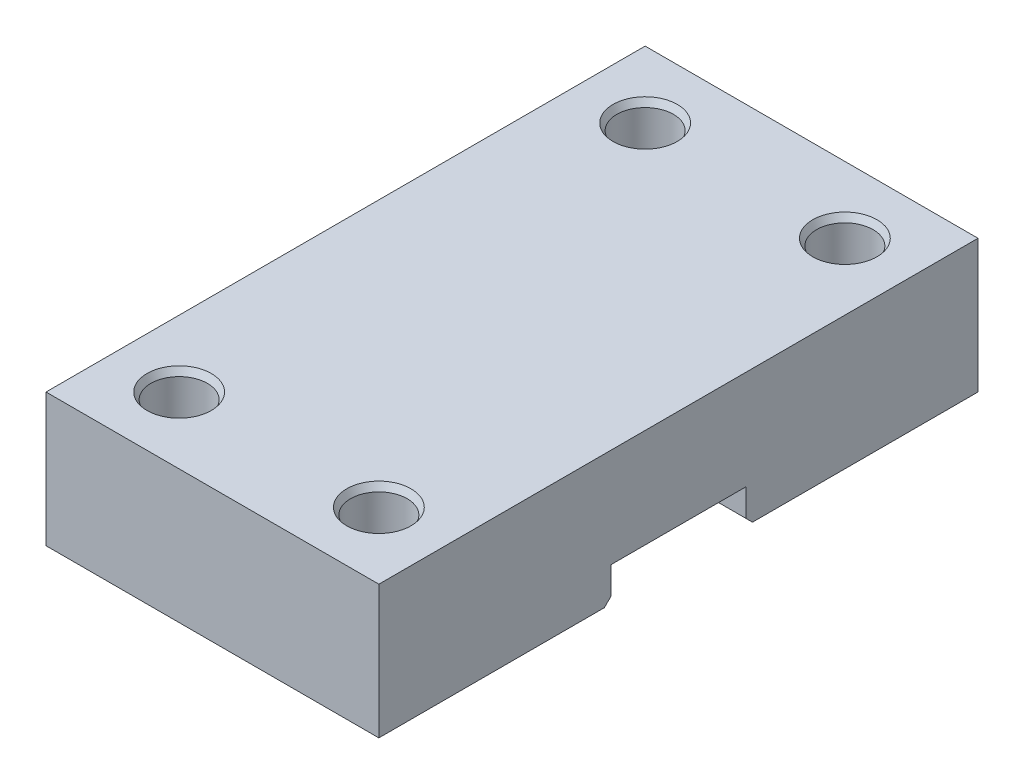
ISO-10303-21;
HEADER;
FILE_DESCRIPTION(('STEP AP214'),'2;1');
FILE_NAME('part.step','',(''),(''),'','','');
FILE_SCHEMA(('AUTOMOTIVE_DESIGN { 1 0 10303 214 1 1 1 1 }'));
ENDSEC;
DATA;
#1=APPLICATION_CONTEXT('core data for automotive mechanical design processes');
#2=APPLICATION_PROTOCOL_DEFINITION('international standard','automotive_design',2000,#1);
#3=PRODUCT_CONTEXT('',#1,'mechanical');
#4=PRODUCT('Part','Part','',(#3));
#5=PRODUCT_RELATED_PRODUCT_CATEGORY('part','',(#4));
#6=PRODUCT_DEFINITION_FORMATION('','',#4);
#7=PRODUCT_DEFINITION_CONTEXT('part definition',#1,'design');
#8=PRODUCT_DEFINITION('design','',#6,#7);
#9=PRODUCT_DEFINITION_SHAPE('','',#8);
#10=(LENGTH_UNIT() NAMED_UNIT(*) SI_UNIT(.MILLI.,.METRE.));
#11=(NAMED_UNIT(*) PLANE_ANGLE_UNIT() SI_UNIT($,.RADIAN.));
#12=(NAMED_UNIT(*) SI_UNIT($,.STERADIAN.) SOLID_ANGLE_UNIT());
#13=UNCERTAINTY_MEASURE_WITH_UNIT(LENGTH_MEASURE(1.E-05),#10,'distance_accuracy_value','');
#14=(GEOMETRIC_REPRESENTATION_CONTEXT(3) GLOBAL_UNCERTAINTY_ASSIGNED_CONTEXT((#13)) GLOBAL_UNIT_ASSIGNED_CONTEXT((#10,
#11,#12)) REPRESENTATION_CONTEXT('',''));
#15=CARTESIAN_POINT('',(0.,0.,0.));
#16=DIRECTION('',(0.,0.,1.));
#17=DIRECTION('',(1.,0.,0.));
#18=AXIS2_PLACEMENT_3D('',#15,#16,#17);
#19=CARTESIAN_POINT('',(0.,0.,0.));
#20=DIRECTION('',(0.,1.,0.));
#21=DIRECTION('',(0.,0.,1.));
#22=AXIS2_PLACEMENT_3D('',#19,#20,#21);
#23=PLANE('',#22);
#24=CARTESIAN_POINT('',(15.,0.,35.));
#25=DIRECTION('',(0.,-1.,0.));
#26=DIRECTION('',(0.,0.,-1.));
#27=AXIS2_PLACEMENT_3D('',#24,#25,#26);
#28=CIRCLE('',#27,4.25);
#29=CARTESIAN_POINT('',(15.,0.,30.75));
#30=VERTEX_POINT('',#29);
#31=EDGE_CURVE('E244',#30,#30,#28,.T.);
#32=ORIENTED_EDGE('',*,*,#31,.F.);
#33=EDGE_LOOP('',(#32));
#34=FACE_BOUND('',#33,.T.);
#35=CARTESIAN_POINT('',(-15.,0.,35.));
#36=DIRECTION('',(0.,-1.,0.));
#37=DIRECTION('',(0.,0.,-1.));
#38=AXIS2_PLACEMENT_3D('',#35,#36,#37);
#39=CIRCLE('',#38,4.25);
#40=CARTESIAN_POINT('',(-15.,0.,30.75));
#41=VERTEX_POINT('',#40);
#42=EDGE_CURVE('E242',#41,#41,#39,.T.);
#43=ORIENTED_EDGE('',*,*,#42,.F.);
#44=EDGE_LOOP('',(#43));
#45=FACE_BOUND('',#44,.T.);
#46=DIRECTION('',(0.,0.,1.));
#47=VECTOR('',#46,1.);
#48=CARTESIAN_POINT('',(-25.,0.,45.));
#49=LINE('',#48,#47);
#50=CARTESIAN_POINT('',(-25.,0.,11.125));
#51=VERTEX_POINT('',#50);
#52=CARTESIAN_POINT('',(-25.,0.,45.));
#53=VERTEX_POINT('',#52);
#54=EDGE_CURVE('E145',#51,#53,#49,.T.);
#55=ORIENTED_EDGE('',*,*,#54,.F.);
#56=DIRECTION('',(1.,0.,0.));
#57=VECTOR('',#56,1.);
#58=CARTESIAN_POINT('',(0.,0.,11.125));
#59=LINE('',#58,#57);
#60=CARTESIAN_POINT('',(25.,0.,11.125));
#61=VERTEX_POINT('',#60);
#62=EDGE_CURVE('E45',#51,#61,#59,.T.);
#63=ORIENTED_EDGE('',*,*,#62,.T.);
#64=DIRECTION('',(0.,0.,-1.));
#65=VECTOR('',#64,1.);
#66=CARTESIAN_POINT('',(25.,0.,45.));
#67=LINE('',#66,#65);
#68=CARTESIAN_POINT('',(25.,0.,45.));
#69=VERTEX_POINT('',#68);
#70=EDGE_CURVE('E162',#69,#61,#67,.T.);
#71=ORIENTED_EDGE('',*,*,#70,.F.);
#72=DIRECTION('',(1.,0.,0.));
#73=VECTOR('',#72,1.);
#74=CARTESIAN_POINT('',(25.,0.,45.));
#75=LINE('',#74,#73);
#76=EDGE_CURVE('E159',#53,#69,#75,.T.);
#77=ORIENTED_EDGE('',*,*,#76,.F.);
#78=EDGE_LOOP('',(#55,#63,#71,#77));
#79=FACE_BOUND('',#78,.T.);
#80=ADVANCED_FACE('F37',(#34,#45,#79),#23,.F.);
#81=CARTESIAN_POINT('',(-25.,20.,45.));
#82=DIRECTION('',(1.,0.,0.));
#83=DIRECTION('',(0.,0.,-1.));
#84=AXIS2_PLACEMENT_3D('',#81,#82,#83);
#85=PLANE('',#84);
#86=CARTESIAN_POINT('',(-25.,0.,-45.));
#87=VERTEX_POINT('',#86);
#88=CARTESIAN_POINT('',(-25.,0.,-11.125));
#89=VERTEX_POINT('',#88);
#90=EDGE_CURVE('E157',#87,#89,#49,.T.);
#91=ORIENTED_EDGE('',*,*,#90,.T.);
#92=DIRECTION('',(0.,-0.707106781186552,-0.707106781186543));
#93=VECTOR('',#92,1.);
#94=CARTESIAN_POINT('',(-25.,1.00000000000003,-10.125));
#95=LINE('',#94,#93);
#96=CARTESIAN_POINT('',(-25.,1.00000000000003,-10.125));
#97=VERTEX_POINT('',#96);
#98=EDGE_CURVE('E120',#89,#97,#95,.F.);
#99=ORIENTED_EDGE('',*,*,#98,.T.);
#100=DIRECTION('',(0.,1.,0.));
#101=VECTOR('',#100,1.);
#102=CARTESIAN_POINT('',(-25.,5.10000000000001,-10.125));
#103=LINE('',#102,#101);
#104=CARTESIAN_POINT('',(-25.,5.10000000000001,-10.125));
#105=VERTEX_POINT('',#104);
#106=EDGE_CURVE('E113',#97,#105,#103,.T.);
#107=ORIENTED_EDGE('',*,*,#106,.T.);
#108=DIRECTION('',(0.,0.,1.));
#109=VECTOR('',#108,1.);
#110=CARTESIAN_POINT('',(-25.,5.10000000000001,-10.125));
#111=LINE('',#110,#109);
#112=CARTESIAN_POINT('',(-25.,5.1,10.125));
#113=VERTEX_POINT('',#112);
#114=EDGE_CURVE('E118',#105,#113,#111,.T.);
#115=ORIENTED_EDGE('',*,*,#114,.T.);
#116=DIRECTION('',(0.,-1.,0.));
#117=VECTOR('',#116,1.);
#118=CARTESIAN_POINT('',(-25.,5.1,10.125));
#119=LINE('',#118,#117);
#120=CARTESIAN_POINT('',(-25.,1.00000000000001,10.125));
#121=VERTEX_POINT('',#120);
#122=EDGE_CURVE('E124',#113,#121,#119,.T.);
#123=ORIENTED_EDGE('',*,*,#122,.T.);
#124=DIRECTION('',(0.,0.707106781186548,-0.707106781186548));
#125=VECTOR('',#124,1.);
#126=CARTESIAN_POINT('',(-25.,0.,11.125));
#127=LINE('',#126,#125);
#128=EDGE_CURVE('E52',#121,#51,#127,.F.);
#129=ORIENTED_EDGE('',*,*,#128,.T.);
#130=ORIENTED_EDGE('',*,*,#54,.T.);
#131=DIRECTION('',(0.,-1.,0.));
#132=VECTOR('',#131,1.);
#133=CARTESIAN_POINT('',(-25.,20.,45.));
#134=LINE('',#133,#132);
#135=CARTESIAN_POINT('',(-25.,20.,45.));
#136=VERTEX_POINT('',#135);
#137=EDGE_CURVE('E174',#136,#53,#134,.T.);
#138=ORIENTED_EDGE('',*,*,#137,.F.);
#139=DIRECTION('',(0.,0.,1.));
#140=VECTOR('',#139,1.);
#141=CARTESIAN_POINT('',(-25.,20.,45.));
#142=LINE('',#141,#140);
#143=CARTESIAN_POINT('',(-25.,20.,-45.));
#144=VERTEX_POINT('',#143);
#145=EDGE_CURVE('E146',#144,#136,#142,.T.);
#146=ORIENTED_EDGE('',*,*,#145,.F.);
#147=DIRECTION('',(0.,-1.,0.));
#148=VECTOR('',#147,1.);
#149=CARTESIAN_POINT('',(-25.,20.,-45.));
#150=LINE('',#149,#148);
#151=EDGE_CURVE('E156',#144,#87,#150,.T.);
#152=ORIENTED_EDGE('',*,*,#151,.T.);
#153=EDGE_LOOP('',(#91,#99,#107,#115,#123,#129,#130,#138,#146,#152));
#154=FACE_BOUND('',#153,.T.);
#155=ADVANCED_FACE('F116',(#154),#85,.F.);
#156=CARTESIAN_POINT('',(25.,20.,45.));
#157=DIRECTION('',(0.,0.,-1.));
#158=DIRECTION('',(-1.,0.,0.));
#159=AXIS2_PLACEMENT_3D('',#156,#157,#158);
#160=PLANE('',#159);
#161=ORIENTED_EDGE('',*,*,#76,.T.);
#162=DIRECTION('',(0.,-1.,0.));
#163=VECTOR('',#162,1.);
#164=CARTESIAN_POINT('',(25.,20.,45.));
#165=LINE('',#164,#163);
#166=CARTESIAN_POINT('',(25.,20.,45.));
#167=VERTEX_POINT('',#166);
#168=EDGE_CURVE('E171',#167,#69,#165,.T.);
#169=ORIENTED_EDGE('',*,*,#168,.F.);
#170=DIRECTION('',(1.,0.,0.));
#171=VECTOR('',#170,1.);
#172=CARTESIAN_POINT('',(25.,20.,45.));
#173=LINE('',#172,#171);
#174=EDGE_CURVE('E149',#136,#167,#173,.T.);
#175=ORIENTED_EDGE('',*,*,#174,.F.);
#176=ORIENTED_EDGE('',*,*,#137,.T.);
#177=EDGE_LOOP('',(#161,#169,#175,#176));
#178=FACE_BOUND('',#177,.T.);
#179=ADVANCED_FACE('F224',(#178),#160,.F.);
#180=CARTESIAN_POINT('',(25.,20.,45.));
#181=DIRECTION('',(-1.,0.,0.));
#182=DIRECTION('',(0.,0.,1.));
#183=AXIS2_PLACEMENT_3D('',#180,#181,#182);
#184=PLANE('',#183);
#185=DIRECTION('',(0.,-1.,0.));
#186=VECTOR('',#185,1.);
#187=CARTESIAN_POINT('',(25.,20.,-10.125));
#188=LINE('',#187,#186);
#189=CARTESIAN_POINT('',(25.,5.10000000000001,-10.125));
#190=VERTEX_POINT('',#189);
#191=CARTESIAN_POINT('',(25.,1.00000000000003,-10.125));
#192=VERTEX_POINT('',#191);
#193=EDGE_CURVE('E130',#190,#192,#188,.T.);
#194=ORIENTED_EDGE('',*,*,#193,.T.);
#195=DIRECTION('',(0.,0.707106781186552,0.707106781186543));
#196=VECTOR('',#195,1.);
#197=CARTESIAN_POINT('',(25.,1.00000000000003,-10.125));
#198=LINE('',#197,#196);
#199=CARTESIAN_POINT('',(25.,0.,-11.125));
#200=VERTEX_POINT('',#199);
#201=EDGE_CURVE('E207',#192,#200,#198,.F.);
#202=ORIENTED_EDGE('',*,*,#201,.T.);
#203=CARTESIAN_POINT('',(25.,0.,-45.));
#204=VERTEX_POINT('',#203);
#205=EDGE_CURVE('E161',#200,#204,#67,.T.);
#206=ORIENTED_EDGE('',*,*,#205,.T.);
#207=DIRECTION('',(0.,-1.,0.));
#208=VECTOR('',#207,1.);
#209=CARTESIAN_POINT('',(25.,20.,-45.));
#210=LINE('',#209,#208);
#211=CARTESIAN_POINT('',(25.,20.,-45.));
#212=VERTEX_POINT('',#211);
#213=EDGE_CURVE('E168',#212,#204,#210,.T.);
#214=ORIENTED_EDGE('',*,*,#213,.F.);
#215=DIRECTION('',(0.,0.,-1.));
#216=VECTOR('',#215,1.);
#217=CARTESIAN_POINT('',(25.,20.,45.));
#218=LINE('',#217,#216);
#219=EDGE_CURVE('E152',#167,#212,#218,.T.);
#220=ORIENTED_EDGE('',*,*,#219,.F.);
#221=ORIENTED_EDGE('',*,*,#168,.T.);
#222=ORIENTED_EDGE('',*,*,#70,.T.);
#223=DIRECTION('',(0.,-0.707106781186548,0.707106781186548));
#224=VECTOR('',#223,1.);
#225=CARTESIAN_POINT('',(25.,0.,11.125));
#226=LINE('',#225,#224);
#227=CARTESIAN_POINT('',(25.,1.00000000000001,10.125));
#228=VERTEX_POINT('',#227);
#229=EDGE_CURVE('E205',#61,#228,#226,.F.);
#230=ORIENTED_EDGE('',*,*,#229,.T.);
#231=DIRECTION('',(0.,1.,0.));
#232=VECTOR('',#231,1.);
#233=CARTESIAN_POINT('',(25.,20.,10.125));
#234=LINE('',#233,#232);
#235=CARTESIAN_POINT('',(25.,5.1,10.125));
#236=VERTEX_POINT('',#235);
#237=EDGE_CURVE('E143',#228,#236,#234,.T.);
#238=ORIENTED_EDGE('',*,*,#237,.T.);
#239=DIRECTION('',(0.,0.,-1.));
#240=VECTOR('',#239,1.);
#241=CARTESIAN_POINT('',(25.,5.1,45.));
#242=LINE('',#241,#240);
#243=EDGE_CURVE('E177',#236,#190,#242,.T.);
#244=ORIENTED_EDGE('',*,*,#243,.T.);
#245=EDGE_LOOP('',(#194,#202,#206,#214,#220,#221,#222,#230,#238,#244));
#246=FACE_BOUND('',#245,.T.);
#247=ADVANCED_FACE('F219',(#246),#184,.F.);
#248=CARTESIAN_POINT('',(25.,20.,-45.));
#249=DIRECTION('',(0.,0.,1.));
#250=DIRECTION('',(1.,0.,0.));
#251=AXIS2_PLACEMENT_3D('',#248,#249,#250);
#252=PLANE('',#251);
#253=DIRECTION('',(-1.,0.,0.));
#254=VECTOR('',#253,1.);
#255=CARTESIAN_POINT('',(25.,0.,-45.));
#256=LINE('',#255,#254);
#257=EDGE_CURVE('E150',#204,#87,#256,.T.);
#258=ORIENTED_EDGE('',*,*,#257,.T.);
#259=ORIENTED_EDGE('',*,*,#151,.F.);
#260=DIRECTION('',(-1.,0.,0.));
#261=VECTOR('',#260,1.);
#262=CARTESIAN_POINT('',(25.,20.,-45.));
#263=LINE('',#262,#261);
#264=EDGE_CURVE('E154',#212,#144,#263,.T.);
#265=ORIENTED_EDGE('',*,*,#264,.F.);
#266=ORIENTED_EDGE('',*,*,#213,.T.);
#267=EDGE_LOOP('',(#258,#259,#265,#266));
#268=FACE_BOUND('',#267,.T.);
#269=ADVANCED_FACE('F233',(#268),#252,.F.);
#270=CARTESIAN_POINT('',(0.,20.,0.));
#271=DIRECTION('',(0.,1.,0.));
#272=DIRECTION('',(0.,0.,1.));
#273=AXIS2_PLACEMENT_3D('',#270,#271,#272);
#274=PLANE('',#273);
#275=CARTESIAN_POINT('',(15.,20.,-35.));
#276=DIRECTION('',(0.,1.,0.));
#277=DIRECTION('',(0.,0.,1.));
#278=AXIS2_PLACEMENT_3D('',#275,#276,#277);
#279=CIRCLE('',#278,4.82735026918962);
#280=CARTESIAN_POINT('',(15.,20.,-30.1726497308104));
#281=VERTEX_POINT('',#280);
#282=EDGE_CURVE('E188',#281,#281,#279,.F.);
#283=ORIENTED_EDGE('',*,*,#282,.T.);
#284=EDGE_LOOP('',(#283));
#285=FACE_BOUND('',#284,.T.);
#286=CARTESIAN_POINT('',(15.,20.,35.));
#287=DIRECTION('',(0.,1.,0.));
#288=DIRECTION('',(0.,0.,1.));
#289=AXIS2_PLACEMENT_3D('',#286,#287,#288);
#290=CIRCLE('',#289,4.82735026918962);
#291=CARTESIAN_POINT('',(15.,20.,39.8273502691896));
#292=VERTEX_POINT('',#291);
#293=EDGE_CURVE('E185',#292,#292,#290,.F.);
#294=ORIENTED_EDGE('',*,*,#293,.T.);
#295=EDGE_LOOP('',(#294));
#296=FACE_BOUND('',#295,.T.);
#297=CARTESIAN_POINT('',(-15.,20.,35.));
#298=DIRECTION('',(0.,1.,0.));
#299=DIRECTION('',(0.,0.,1.));
#300=AXIS2_PLACEMENT_3D('',#297,#298,#299);
#301=CIRCLE('',#300,4.82735026918962);
#302=CARTESIAN_POINT('',(-15.,20.,39.8273502691896));
#303=VERTEX_POINT('',#302);
#304=EDGE_CURVE('E182',#303,#303,#301,.F.);
#305=ORIENTED_EDGE('',*,*,#304,.T.);
#306=EDGE_LOOP('',(#305));
#307=FACE_BOUND('',#306,.T.);
#308=CARTESIAN_POINT('',(-15.,20.,-35.));
#309=DIRECTION('',(0.,1.,0.));
#310=DIRECTION('',(0.,0.,1.));
#311=AXIS2_PLACEMENT_3D('',#308,#309,#310);
#312=CIRCLE('',#311,4.82735026918962);
#313=CARTESIAN_POINT('',(-15.,20.,-30.1726497308104));
#314=VERTEX_POINT('',#313);
#315=EDGE_CURVE('E179',#314,#314,#312,.F.);
#316=ORIENTED_EDGE('',*,*,#315,.T.);
#317=EDGE_LOOP('',(#316));
#318=FACE_BOUND('',#317,.T.);
#319=ORIENTED_EDGE('',*,*,#145,.T.);
#320=ORIENTED_EDGE('',*,*,#174,.T.);
#321=ORIENTED_EDGE('',*,*,#219,.T.);
#322=ORIENTED_EDGE('',*,*,#264,.T.);
#323=EDGE_LOOP('',(#319,#320,#321,#322));
#324=FACE_BOUND('',#323,.T.);
#325=ADVANCED_FACE('F230',(#285,#296,#307,#318,#324),#274,.T.);
#326=CARTESIAN_POINT('',(15.,0.,-35.));
#327=DIRECTION('',(0.,-1.,0.));
#328=DIRECTION('',(0.,0.,-1.));
#329=AXIS2_PLACEMENT_3D('',#326,#327,#328);
#330=CIRCLE('',#329,4.25);
#331=CARTESIAN_POINT('',(15.,0.,-39.25));
#332=VERTEX_POINT('',#331);
#333=EDGE_CURVE('E250',#332,#332,#330,.T.);
#334=ORIENTED_EDGE('',*,*,#333,.F.);
#335=EDGE_LOOP('',(#334));
#336=FACE_BOUND('',#335,.T.);
#337=CARTESIAN_POINT('',(-15.,0.,-35.));
#338=DIRECTION('',(0.,-1.,0.));
#339=DIRECTION('',(0.,0.,-1.));
#340=AXIS2_PLACEMENT_3D('',#337,#338,#339);
#341=CIRCLE('',#340,4.25);
#342=CARTESIAN_POINT('',(-15.,0.,-39.25));
#343=VERTEX_POINT('',#342);
#344=EDGE_CURVE('E247',#343,#343,#341,.T.);
#345=ORIENTED_EDGE('',*,*,#344,.F.);
#346=EDGE_LOOP('',(#345));
#347=FACE_BOUND('',#346,.T.);
#348=ORIENTED_EDGE('',*,*,#205,.F.);
#349=DIRECTION('',(-1.,0.,0.));
#350=VECTOR('',#349,1.);
#351=CARTESIAN_POINT('',(0.,0.,-11.125));
#352=LINE('',#351,#350);
#353=EDGE_CURVE('E209',#200,#89,#352,.T.);
#354=ORIENTED_EDGE('',*,*,#353,.T.);
#355=ORIENTED_EDGE('',*,*,#90,.F.);
#356=ORIENTED_EDGE('',*,*,#257,.F.);
#357=EDGE_LOOP('',(#348,#354,#355,#356));
#358=FACE_BOUND('',#357,.T.);
#359=ADVANCED_FACE('F237',(#336,#347,#358),#23,.F.);
#360=CARTESIAN_POINT('',(-25.,5.10000000000001,-10.125));
#361=DIRECTION('',(0.,1.,0.));
#362=DIRECTION('',(0.,0.,1.));
#363=AXIS2_PLACEMENT_3D('',#360,#361,#362);
#364=PLANE('',#363);
#365=DIRECTION('',(1.,0.,0.));
#366=VECTOR('',#365,1.);
#367=CARTESIAN_POINT('',(-25.,5.1,10.125));
#368=LINE('',#367,#366);
#369=EDGE_CURVE('E134',#113,#236,#368,.T.);
#370=ORIENTED_EDGE('',*,*,#369,.F.);
#371=ORIENTED_EDGE('',*,*,#114,.F.);
#372=DIRECTION('',(1.,0.,0.));
#373=VECTOR('',#372,1.);
#374=CARTESIAN_POINT('',(-25.,5.10000000000001,-10.125));
#375=LINE('',#374,#373);
#376=EDGE_CURVE('E127',#105,#190,#375,.T.);
#377=ORIENTED_EDGE('',*,*,#376,.T.);
#378=ORIENTED_EDGE('',*,*,#243,.F.);
#379=EDGE_LOOP('',(#370,#371,#377,#378));
#380=FACE_BOUND('',#379,.T.);
#381=ADVANCED_FACE('F136',(#380),#364,.F.);
#382=CARTESIAN_POINT('',(-25.,5.1,10.125));
#383=DIRECTION('',(0.,0.,1.));
#384=DIRECTION('',(1.,0.,0.));
#385=AXIS2_PLACEMENT_3D('',#382,#383,#384);
#386=PLANE('',#385);
#387=ORIENTED_EDGE('',*,*,#237,.F.);
#388=DIRECTION('',(-1.,0.,0.));
#389=VECTOR('',#388,1.);
#390=CARTESIAN_POINT('',(-25.,1.00000000000001,10.125));
#391=LINE('',#390,#389);
#392=EDGE_CURVE('E11',#228,#121,#391,.T.);
#393=ORIENTED_EDGE('',*,*,#392,.T.);
#394=ORIENTED_EDGE('',*,*,#122,.F.);
#395=ORIENTED_EDGE('',*,*,#369,.T.);
#396=EDGE_LOOP('',(#387,#393,#394,#395));
#397=FACE_BOUND('',#396,.T.);
#398=ADVANCED_FACE('F241',(#397),#386,.F.);
#399=CARTESIAN_POINT('',(-25.,5.10000000000001,-10.125));
#400=DIRECTION('',(0.,0.,-1.));
#401=DIRECTION('',(0.,1.,0.));
#402=AXIS2_PLACEMENT_3D('',#399,#400,#401);
#403=PLANE('',#402);
#404=ORIENTED_EDGE('',*,*,#106,.F.);
#405=DIRECTION('',(1.,0.,0.));
#406=VECTOR('',#405,1.);
#407=CARTESIAN_POINT('',(-25.,1.00000000000003,-10.125));
#408=LINE('',#407,#406);
#409=EDGE_CURVE('E203',#97,#192,#408,.T.);
#410=ORIENTED_EDGE('',*,*,#409,.T.);
#411=ORIENTED_EDGE('',*,*,#193,.F.);
#412=ORIENTED_EDGE('',*,*,#376,.F.);
#413=EDGE_LOOP('',(#404,#410,#411,#412));
#414=FACE_BOUND('',#413,.T.);
#415=ADVANCED_FACE('F128',(#414),#403,.F.);
#416=CARTESIAN_POINT('',(-15.,20.,35.));
#417=DIRECTION('',(0.,-1.,0.));
#418=DIRECTION('',(0.,0.,-1.));
#419=AXIS2_PLACEMENT_3D('',#416,#417,#418);
#420=CYLINDRICAL_SURFACE('',#419,4.25);
#421=CARTESIAN_POINT('',(-15.,19.,35.));
#422=DIRECTION('',(0.,1.,0.));
#423=DIRECTION('',(0.,0.,1.));
#424=AXIS2_PLACEMENT_3D('',#421,#422,#423);
#425=CIRCLE('',#424,4.25);
#426=CARTESIAN_POINT('',(-15.,19.,39.25));
#427=VERTEX_POINT('',#426);
#428=EDGE_CURVE('E197',#427,#427,#425,.T.);
#429=ORIENTED_EDGE('',*,*,#428,.T.);
#430=EDGE_LOOP('',(#429));
#431=FACE_BOUND('',#430,.T.);
#432=ORIENTED_EDGE('',*,*,#42,.T.);
#433=EDGE_LOOP('',(#432));
#434=FACE_BOUND('',#433,.T.);
#435=ADVANCED_FACE('F263',(#431,#434),#420,.F.);
#436=CARTESIAN_POINT('',(-15.,20.,-35.));
#437=DIRECTION('',(0.,-1.,0.));
#438=DIRECTION('',(0.,0.,-1.));
#439=AXIS2_PLACEMENT_3D('',#436,#437,#438);
#440=CYLINDRICAL_SURFACE('',#439,4.25);
#441=CARTESIAN_POINT('',(-15.,19.,-35.));
#442=DIRECTION('',(0.,1.,0.));
#443=DIRECTION('',(0.,0.,1.));
#444=AXIS2_PLACEMENT_3D('',#441,#442,#443);
#445=CIRCLE('',#444,4.25);
#446=CARTESIAN_POINT('',(-15.,19.,-30.75));
#447=VERTEX_POINT('',#446);
#448=EDGE_CURVE('E200',#447,#447,#445,.T.);
#449=ORIENTED_EDGE('',*,*,#448,.T.);
#450=EDGE_LOOP('',(#449));
#451=FACE_BOUND('',#450,.T.);
#452=ORIENTED_EDGE('',*,*,#344,.T.);
#453=EDGE_LOOP('',(#452));
#454=FACE_BOUND('',#453,.T.);
#455=ADVANCED_FACE('F265',(#451,#454),#440,.F.);
#456=CARTESIAN_POINT('',(15.,20.,-35.));
#457=DIRECTION('',(0.,-1.,0.));
#458=DIRECTION('',(0.,0.,-1.));
#459=AXIS2_PLACEMENT_3D('',#456,#457,#458);
#460=CYLINDRICAL_SURFACE('',#459,4.25);
#461=CARTESIAN_POINT('',(15.,19.,-35.));
#462=DIRECTION('',(0.,1.,0.));
#463=DIRECTION('',(0.,0.,1.));
#464=AXIS2_PLACEMENT_3D('',#461,#462,#463);
#465=CIRCLE('',#464,4.25);
#466=CARTESIAN_POINT('',(15.,19.,-30.75));
#467=VERTEX_POINT('',#466);
#468=EDGE_CURVE('E191',#467,#467,#465,.T.);
#469=ORIENTED_EDGE('',*,*,#468,.T.);
#470=EDGE_LOOP('',(#469));
#471=FACE_BOUND('',#470,.T.);
#472=ORIENTED_EDGE('',*,*,#333,.T.);
#473=EDGE_LOOP('',(#472));
#474=FACE_BOUND('',#473,.T.);
#475=ADVANCED_FACE('F272',(#471,#474),#460,.F.);
#476=CARTESIAN_POINT('',(15.,20.,35.));
#477=DIRECTION('',(0.,-1.,0.));
#478=DIRECTION('',(0.,0.,-1.));
#479=AXIS2_PLACEMENT_3D('',#476,#477,#478);
#480=CYLINDRICAL_SURFACE('',#479,4.25);
#481=CARTESIAN_POINT('',(15.,19.,35.));
#482=DIRECTION('',(0.,1.,0.));
#483=DIRECTION('',(0.,0.,1.));
#484=AXIS2_PLACEMENT_3D('',#481,#482,#483);
#485=CIRCLE('',#484,4.25);
#486=CARTESIAN_POINT('',(15.,19.,39.25));
#487=VERTEX_POINT('',#486);
#488=EDGE_CURVE('E194',#487,#487,#485,.T.);
#489=ORIENTED_EDGE('',*,*,#488,.T.);
#490=EDGE_LOOP('',(#489));
#491=FACE_BOUND('',#490,.T.);
#492=ORIENTED_EDGE('',*,*,#31,.T.);
#493=EDGE_LOOP('',(#492));
#494=FACE_BOUND('',#493,.T.);
#495=ADVANCED_FACE('F256',(#491,#494),#480,.F.);
#496=CARTESIAN_POINT('',(15.,20.,-35.));
#497=DIRECTION('',(0.,1.,0.));
#498=DIRECTION('',(0.,0.,1.));
#499=AXIS2_PLACEMENT_3D('',#496,#497,#498);
#500=CONICAL_SURFACE('',#499,4.82735026918962,0.523598775598292);
#501=ORIENTED_EDGE('',*,*,#468,.F.);
#502=EDGE_LOOP('',(#501));
#503=FACE_BOUND('',#502,.T.);
#504=ORIENTED_EDGE('',*,*,#282,.F.);
#505=EDGE_LOOP('',(#504));
#506=FACE_BOUND('',#505,.T.);
#507=ADVANCED_FACE('F295',(#503,#506),#500,.F.);
#508=CARTESIAN_POINT('',(15.,20.,35.));
#509=DIRECTION('',(0.,1.,0.));
#510=DIRECTION('',(0.,0.,1.));
#511=AXIS2_PLACEMENT_3D('',#508,#509,#510);
#512=CONICAL_SURFACE('',#511,4.82735026918962,0.523598775598294);
#513=ORIENTED_EDGE('',*,*,#488,.F.);
#514=EDGE_LOOP('',(#513));
#515=FACE_BOUND('',#514,.T.);
#516=ORIENTED_EDGE('',*,*,#293,.F.);
#517=EDGE_LOOP('',(#516));
#518=FACE_BOUND('',#517,.T.);
#519=ADVANCED_FACE('F298',(#515,#518),#512,.F.);
#520=CARTESIAN_POINT('',(-15.,20.,35.));
#521=DIRECTION('',(0.,1.,0.));
#522=DIRECTION('',(0.,0.,1.));
#523=AXIS2_PLACEMENT_3D('',#520,#521,#522);
#524=CONICAL_SURFACE('',#523,4.82735026918962,0.523598775598294);
#525=ORIENTED_EDGE('',*,*,#428,.F.);
#526=EDGE_LOOP('',(#525));
#527=FACE_BOUND('',#526,.T.);
#528=ORIENTED_EDGE('',*,*,#304,.F.);
#529=EDGE_LOOP('',(#528));
#530=FACE_BOUND('',#529,.T.);
#531=ADVANCED_FACE('F302',(#527,#530),#524,.F.);
#532=CARTESIAN_POINT('',(-15.,20.,-35.));
#533=DIRECTION('',(0.,1.,0.));
#534=DIRECTION('',(0.,0.,1.));
#535=AXIS2_PLACEMENT_3D('',#532,#533,#534);
#536=CONICAL_SURFACE('',#535,4.82735026918962,0.523598775598293);
#537=ORIENTED_EDGE('',*,*,#448,.F.);
#538=EDGE_LOOP('',(#537));
#539=FACE_BOUND('',#538,.T.);
#540=ORIENTED_EDGE('',*,*,#315,.F.);
#541=EDGE_LOOP('',(#540));
#542=FACE_BOUND('',#541,.T.);
#543=ADVANCED_FACE('F306',(#539,#542),#536,.F.);
#544=CARTESIAN_POINT('',(-25.,1.00000000000003,-10.125));
#545=DIRECTION('',(0.,0.707106781186543,-0.707106781186552));
#546=DIRECTION('',(1.,0.,0.));
#547=AXIS2_PLACEMENT_3D('',#544,#545,#546);
#548=PLANE('',#547);
#549=ORIENTED_EDGE('',*,*,#98,.F.);
#550=ORIENTED_EDGE('',*,*,#353,.F.);
#551=ORIENTED_EDGE('',*,*,#201,.F.);
#552=ORIENTED_EDGE('',*,*,#409,.F.);
#553=EDGE_LOOP('',(#549,#550,#551,#552));
#554=FACE_BOUND('',#553,.T.);
#555=ADVANCED_FACE('F240',(#554),#548,.F.);
#556=CARTESIAN_POINT('',(0.,0.,11.125));
#557=DIRECTION('',(0.,0.707106781186547,0.707106781186547));
#558=DIRECTION('',(1.,0.,0.));
#559=AXIS2_PLACEMENT_3D('',#556,#557,#558);
#560=PLANE('',#559);
#561=ORIENTED_EDGE('',*,*,#128,.F.);
#562=ORIENTED_EDGE('',*,*,#392,.F.);
#563=ORIENTED_EDGE('',*,*,#229,.F.);
#564=ORIENTED_EDGE('',*,*,#62,.F.);
#565=EDGE_LOOP('',(#561,#562,#563,#564));
#566=FACE_BOUND('',#565,.T.);
#567=ADVANCED_FACE('F39',(#566),#560,.F.);
#568=CLOSED_SHELL('',(#80,#155,#179,#247,#269,#325,#359,#381,#398,#415,#435,#455,#475,#495,#507,
#519,#531,#543,#555,#567));
#569=MANIFOLD_SOLID_BREP('B2',#568);
#570=ADVANCED_BREP_SHAPE_REPRESENTATION('',(#18,#569),#14);
#571=SHAPE_DEFINITION_REPRESENTATION(#9,#570);
ENDSEC;
END-ISO-10303-21;
